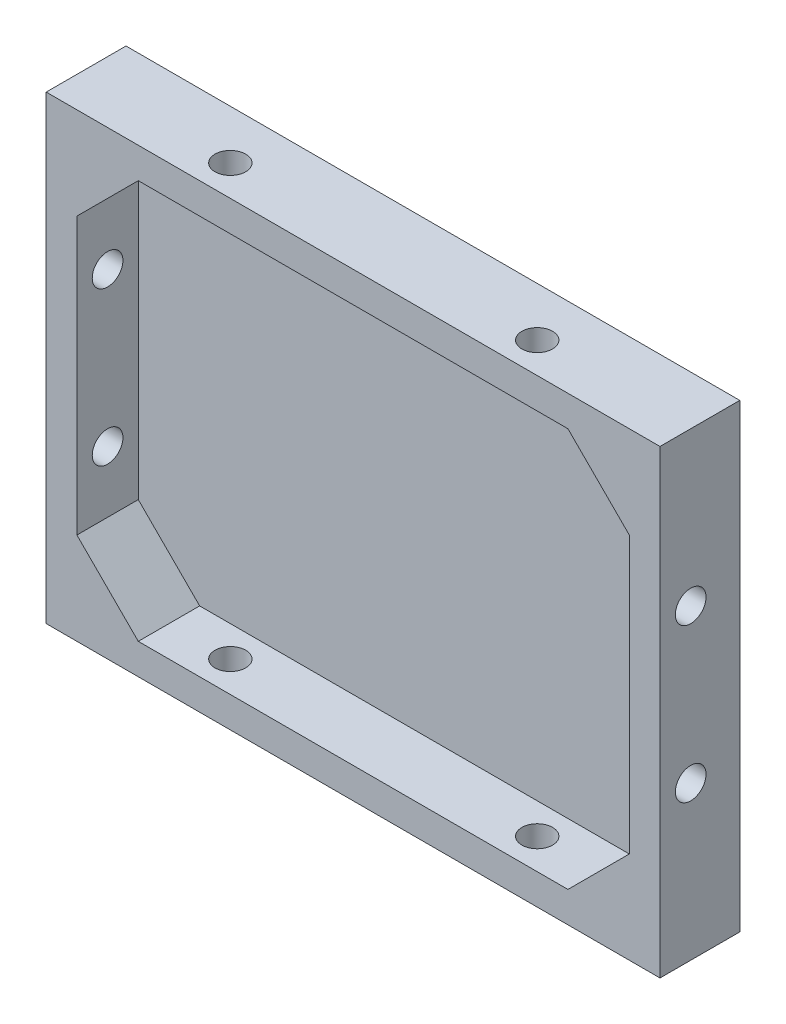
ISO-10303-21;
HEADER;
FILE_DESCRIPTION(('STEP AP214'),'2;1');
FILE_NAME('part.step','',(''),(''),'','','');
FILE_SCHEMA(('AUTOMOTIVE_DESIGN { 1 0 10303 214 1 1 1 1 }'));
ENDSEC;
DATA;
#1=APPLICATION_CONTEXT('core data for automotive mechanical design processes');
#2=APPLICATION_PROTOCOL_DEFINITION('international standard','automotive_design',2000,#1);
#3=PRODUCT_CONTEXT('',#1,'mechanical');
#4=PRODUCT('Part','Part','',(#3));
#5=PRODUCT_RELATED_PRODUCT_CATEGORY('part','',(#4));
#6=PRODUCT_DEFINITION_FORMATION('','',#4);
#7=PRODUCT_DEFINITION_CONTEXT('part definition',#1,'design');
#8=PRODUCT_DEFINITION('design','',#6,#7);
#9=PRODUCT_DEFINITION_SHAPE('','',#8);
#10=(LENGTH_UNIT() NAMED_UNIT(*) SI_UNIT(.MILLI.,.METRE.));
#11=(NAMED_UNIT(*) PLANE_ANGLE_UNIT() SI_UNIT($,.RADIAN.));
#12=(NAMED_UNIT(*) SI_UNIT($,.STERADIAN.) SOLID_ANGLE_UNIT());
#13=UNCERTAINTY_MEASURE_WITH_UNIT(LENGTH_MEASURE(1.E-05),#10,'distance_accuracy_value','');
#14=(GEOMETRIC_REPRESENTATION_CONTEXT(3) GLOBAL_UNCERTAINTY_ASSIGNED_CONTEXT((#13)) GLOBAL_UNIT_ASSIGNED_CONTEXT((#10,
#11,#12)) REPRESENTATION_CONTEXT('',''));
#15=CARTESIAN_POINT('',(0.,0.,0.));
#16=DIRECTION('',(0.,0.,1.));
#17=DIRECTION('',(1.,0.,0.));
#18=AXIS2_PLACEMENT_3D('',#15,#16,#17);
#19=CARTESIAN_POINT('',(0.,0.,3.));
#20=DIRECTION('',(0.,0.,1.));
#21=DIRECTION('',(1.,0.,0.));
#22=AXIS2_PLACEMENT_3D('',#19,#20,#21);
#23=PLANE('',#22);
#24=DIRECTION('',(0.,-1.,0.));
#25=VECTOR('',#24,1.);
#26=CARTESIAN_POINT('',(-40.8815636921236,33.7284482758621,3.));
#27=LINE('',#26,#25);
#28=CARTESIAN_POINT('',(-40.8815636921236,18.7284482758621,3.));
#29=VERTEX_POINT('',#28);
#30=CARTESIAN_POINT('',(-40.8815636921236,-26.2715517241379,3.));
#31=VERTEX_POINT('',#30);
#32=EDGE_CURVE('E141',#29,#31,#27,.T.);
#33=ORIENTED_EDGE('',*,*,#32,.T.);
#34=DIRECTION('',(-0.707106781186548,0.707106781186547,0.));
#35=VECTOR('',#34,1.);
#36=CARTESIAN_POINT('',(-30.8815636921236,-36.2715517241379,3.));
#37=LINE('',#36,#35);
#38=CARTESIAN_POINT('',(-30.8815636921236,-36.2715517241379,3.));
#39=VERTEX_POINT('',#38);
#40=EDGE_CURVE('E50',#39,#31,#37,.T.);
#41=ORIENTED_EDGE('',*,*,#40,.F.);
#42=DIRECTION('',(1.,0.,0.));
#43=VECTOR('',#42,1.);
#44=CARTESIAN_POINT('',(-45.8815636921236,-36.2715517241379,3.));
#45=LINE('',#44,#43);
#46=CARTESIAN_POINT('',(39.1184363078764,-36.2715517241379,3.));
#47=VERTEX_POINT('',#46);
#48=EDGE_CURVE('E231',#39,#47,#45,.T.);
#49=ORIENTED_EDGE('',*,*,#48,.T.);
#50=DIRECTION('',(-0.707106781186547,-0.707106781186548,0.));
#51=VECTOR('',#50,1.);
#52=CARTESIAN_POINT('',(49.1184363078764,-26.2715517241379,3.));
#53=LINE('',#52,#51);
#54=CARTESIAN_POINT('',(49.1184363078764,-26.2715517241379,3.));
#55=VERTEX_POINT('',#54);
#56=EDGE_CURVE('E238',#55,#47,#53,.T.);
#57=ORIENTED_EDGE('',*,*,#56,.F.);
#58=DIRECTION('',(0.,1.,0.));
#59=VECTOR('',#58,1.);
#60=CARTESIAN_POINT('',(49.1184363078764,33.7284482758621,3.));
#61=LINE('',#60,#59);
#62=CARTESIAN_POINT('',(49.1184363078764,18.7284482758621,3.));
#63=VERTEX_POINT('',#62);
#64=EDGE_CURVE('E154',#55,#63,#61,.T.);
#65=ORIENTED_EDGE('',*,*,#64,.T.);
#66=DIRECTION('',(0.707106781186548,-0.707106781186547,0.));
#67=VECTOR('',#66,1.);
#68=CARTESIAN_POINT('',(49.1184363078764,18.7284482758621,3.));
#69=LINE('',#68,#67);
#70=CARTESIAN_POINT('',(39.1184363078764,28.7284482758621,3.));
#71=VERTEX_POINT('',#70);
#72=EDGE_CURVE('E235',#71,#63,#69,.T.);
#73=ORIENTED_EDGE('',*,*,#72,.F.);
#74=DIRECTION('',(-1.,0.,0.));
#75=VECTOR('',#74,1.);
#76=CARTESIAN_POINT('',(-45.8815636921236,28.7284482758621,3.));
#77=LINE('',#76,#75);
#78=CARTESIAN_POINT('',(-30.8815636921236,28.7284482758621,3.));
#79=VERTEX_POINT('',#78);
#80=EDGE_CURVE('E150',#71,#79,#77,.T.);
#81=ORIENTED_EDGE('',*,*,#80,.T.);
#82=DIRECTION('',(0.707106781186548,0.707106781186548,0.));
#83=VECTOR('',#82,1.);
#84=CARTESIAN_POINT('',(-30.8815636921236,28.7284482758621,3.));
#85=LINE('',#84,#83);
#86=EDGE_CURVE('E137',#29,#79,#85,.T.);
#87=ORIENTED_EDGE('',*,*,#86,.F.);
#88=EDGE_LOOP('',(#33,#41,#49,#57,#65,#73,#81,#87));
#89=FACE_BOUND('',#88,.T.);
#90=ADVANCED_FACE('F33',(#89),#23,.T.);
#91=CARTESIAN_POINT('',(-45.8815636921236,-36.2715517241379,13.));
#92=DIRECTION('',(0.,1.,0.));
#93=DIRECTION('',(0.,0.,1.));
#94=AXIS2_PLACEMENT_3D('',#91,#92,#93);
#95=PLANE('',#94);
#96=CARTESIAN_POINT('',(29.1184363078764,-36.2715517241379,8.));
#97=DIRECTION('',(0.,1.,0.));
#98=DIRECTION('',(0.,0.,1.));
#99=AXIS2_PLACEMENT_3D('',#96,#97,#98);
#100=CIRCLE('',#99,2.5);
#101=CARTESIAN_POINT('',(29.1184363078764,-36.2715517241379,10.5));
#102=VERTEX_POINT('',#101);
#103=EDGE_CURVE('E213',#102,#102,#100,.T.);
#104=ORIENTED_EDGE('',*,*,#103,.F.);
#105=EDGE_LOOP('',(#104));
#106=FACE_BOUND('',#105,.T.);
#107=CARTESIAN_POINT('',(-20.8815636921236,-36.2715517241379,8.));
#108=DIRECTION('',(0.,1.,0.));
#109=DIRECTION('',(0.,0.,1.));
#110=AXIS2_PLACEMENT_3D('',#107,#108,#109);
#111=CIRCLE('',#110,2.5);
#112=CARTESIAN_POINT('',(-20.8815636921236,-36.2715517241379,10.5));
#113=VERTEX_POINT('',#112);
#114=EDGE_CURVE('E200',#113,#113,#111,.T.);
#115=ORIENTED_EDGE('',*,*,#114,.F.);
#116=EDGE_LOOP('',(#115));
#117=FACE_BOUND('',#116,.T.);
#118=ORIENTED_EDGE('',*,*,#48,.F.);
#119=DIRECTION('',(0.,0.,-1.));
#120=VECTOR('',#119,1.);
#121=CARTESIAN_POINT('',(-30.8815636921236,-36.2715517241379,27.142135623731));
#122=LINE('',#121,#120);
#123=CARTESIAN_POINT('',(-30.8815636921236,-36.2715517241379,13.));
#124=VERTEX_POINT('',#123);
#125=EDGE_CURVE('E284',#124,#39,#122,.T.);
#126=ORIENTED_EDGE('',*,*,#125,.F.);
#127=DIRECTION('',(1.,0.,0.));
#128=VECTOR('',#127,1.);
#129=CARTESIAN_POINT('',(-45.8815636921236,-36.2715517241379,13.));
#130=LINE('',#129,#128);
#131=CARTESIAN_POINT('',(39.1184363078764,-36.2715517241379,13.));
#132=VERTEX_POINT('',#131);
#133=EDGE_CURVE('E149',#124,#132,#130,.T.);
#134=ORIENTED_EDGE('',*,*,#133,.T.);
#135=DIRECTION('',(0.,0.,-1.));
#136=VECTOR('',#135,1.);
#137=CARTESIAN_POINT('',(39.1184363078764,-36.2715517241379,27.142135623731));
#138=LINE('',#137,#136);
#139=EDGE_CURVE('E258',#132,#47,#138,.T.);
#140=ORIENTED_EDGE('',*,*,#139,.T.);
#141=EDGE_LOOP('',(#118,#126,#134,#140));
#142=FACE_BOUND('',#141,.T.);
#143=ADVANCED_FACE('F298',(#106,#117,#142),#95,.T.);
#144=CARTESIAN_POINT('',(-40.8815636921236,33.7284482758621,13.));
#145=DIRECTION('',(1.,0.,0.));
#146=DIRECTION('',(0.,1.,0.));
#147=AXIS2_PLACEMENT_3D('',#144,#145,#146);
#148=PLANE('',#147);
#149=CARTESIAN_POINT('',(-40.8815636921236,8.72844827586206,8.));
#150=DIRECTION('',(1.,0.,0.));
#151=DIRECTION('',(0.,1.,0.));
#152=AXIS2_PLACEMENT_3D('',#149,#150,#151);
#153=CIRCLE('',#152,2.5);
#154=CARTESIAN_POINT('',(-40.8815636921236,11.2284482758621,8.));
#155=VERTEX_POINT('',#154);
#156=EDGE_CURVE('E196',#155,#155,#153,.T.);
#157=ORIENTED_EDGE('',*,*,#156,.F.);
#158=EDGE_LOOP('',(#157));
#159=FACE_BOUND('',#158,.T.);
#160=CARTESIAN_POINT('',(-40.8815636921236,-16.2715517241379,8.));
#161=DIRECTION('',(1.,0.,0.));
#162=DIRECTION('',(0.,1.,0.));
#163=AXIS2_PLACEMENT_3D('',#160,#161,#162);
#164=CIRCLE('',#163,2.5);
#165=CARTESIAN_POINT('',(-40.8815636921236,-13.7715517241379,8.));
#166=VERTEX_POINT('',#165);
#167=EDGE_CURVE('E192',#166,#166,#164,.T.);
#168=ORIENTED_EDGE('',*,*,#167,.F.);
#169=EDGE_LOOP('',(#168));
#170=FACE_BOUND('',#169,.T.);
#171=DIRECTION('',(0.,-1.,0.));
#172=VECTOR('',#171,1.);
#173=CARTESIAN_POINT('',(-40.8815636921236,33.7284482758621,13.));
#174=LINE('',#173,#172);
#175=CARTESIAN_POINT('',(-40.8815636921236,18.7284482758621,13.));
#176=VERTEX_POINT('',#175);
#177=CARTESIAN_POINT('',(-40.8815636921236,-26.2715517241379,13.));
#178=VERTEX_POINT('',#177);
#179=EDGE_CURVE('E140',#176,#178,#174,.T.);
#180=ORIENTED_EDGE('',*,*,#179,.T.);
#181=DIRECTION('',(0.,0.,-1.));
#182=VECTOR('',#181,1.);
#183=CARTESIAN_POINT('',(-40.8815636921236,-26.2715517241379,27.142135623731));
#184=LINE('',#183,#182);
#185=EDGE_CURVE('E58',#178,#31,#184,.T.);
#186=ORIENTED_EDGE('',*,*,#185,.T.);
#187=ORIENTED_EDGE('',*,*,#32,.F.);
#188=DIRECTION('',(0.,0.,-1.));
#189=VECTOR('',#188,1.);
#190=CARTESIAN_POINT('',(-40.8815636921236,18.7284482758621,27.142135623731));
#191=LINE('',#190,#189);
#192=EDGE_CURVE('E129',#176,#29,#191,.T.);
#193=ORIENTED_EDGE('',*,*,#192,.F.);
#194=EDGE_LOOP('',(#180,#186,#187,#193));
#195=FACE_BOUND('',#194,.T.);
#196=ADVANCED_FACE('F139',(#159,#170,#195),#148,.T.);
#197=CARTESIAN_POINT('',(49.1184363078764,33.7284482758621,13.));
#198=DIRECTION('',(-1.,0.,0.));
#199=DIRECTION('',(0.,0.,1.));
#200=AXIS2_PLACEMENT_3D('',#197,#198,#199);
#201=PLANE('',#200);
#202=CARTESIAN_POINT('',(49.1184363078764,8.72844827586206,8.));
#203=DIRECTION('',(-1.,0.,0.));
#204=DIRECTION('',(0.,0.,1.));
#205=AXIS2_PLACEMENT_3D('',#202,#203,#204);
#206=CIRCLE('',#205,2.5);
#207=CARTESIAN_POINT('',(49.1184363078764,6.22844827586206,8.));
#208=VERTEX_POINT('',#207);
#209=EDGE_CURVE('E194',#208,#208,#206,.T.);
#210=ORIENTED_EDGE('',*,*,#209,.F.);
#211=EDGE_LOOP('',(#210));
#212=FACE_BOUND('',#211,.T.);
#213=CARTESIAN_POINT('',(49.1184363078764,-16.2715517241379,8.));
#214=DIRECTION('',(-1.,0.,0.));
#215=DIRECTION('',(0.,0.,1.));
#216=AXIS2_PLACEMENT_3D('',#213,#214,#215);
#217=CIRCLE('',#216,2.5);
#218=CARTESIAN_POINT('',(49.1184363078764,-18.7715517241379,8.));
#219=VERTEX_POINT('',#218);
#220=EDGE_CURVE('E189',#219,#219,#217,.T.);
#221=ORIENTED_EDGE('',*,*,#220,.F.);
#222=EDGE_LOOP('',(#221));
#223=FACE_BOUND('',#222,.T.);
#224=ORIENTED_EDGE('',*,*,#64,.F.);
#225=DIRECTION('',(0.,0.,-1.));
#226=VECTOR('',#225,1.);
#227=CARTESIAN_POINT('',(49.1184363078764,-26.2715517241379,27.142135623731));
#228=LINE('',#227,#226);
#229=CARTESIAN_POINT('',(49.1184363078764,-26.2715517241379,13.));
#230=VERTEX_POINT('',#229);
#231=EDGE_CURVE('E291',#230,#55,#228,.T.);
#232=ORIENTED_EDGE('',*,*,#231,.F.);
#233=DIRECTION('',(0.,1.,0.));
#234=VECTOR('',#233,1.);
#235=CARTESIAN_POINT('',(49.1184363078764,33.7284482758621,13.));
#236=LINE('',#235,#234);
#237=CARTESIAN_POINT('',(49.1184363078764,18.7284482758621,13.));
#238=VERTEX_POINT('',#237);
#239=EDGE_CURVE('E152',#230,#238,#236,.T.);
#240=ORIENTED_EDGE('',*,*,#239,.T.);
#241=DIRECTION('',(0.,0.,-1.));
#242=VECTOR('',#241,1.);
#243=CARTESIAN_POINT('',(49.1184363078764,18.7284482758621,27.142135623731));
#244=LINE('',#243,#242);
#245=EDGE_CURVE('E242',#238,#63,#244,.T.);
#246=ORIENTED_EDGE('',*,*,#245,.T.);
#247=EDGE_LOOP('',(#224,#232,#240,#246));
#248=FACE_BOUND('',#247,.T.);
#249=ADVANCED_FACE('F243',(#212,#223,#248),#201,.T.);
#250=CARTESIAN_POINT('',(-45.8815636921236,28.7284482758621,13.));
#251=DIRECTION('',(0.,-1.,0.));
#252=DIRECTION('',(0.,0.,-1.));
#253=AXIS2_PLACEMENT_3D('',#250,#251,#252);
#254=PLANE('',#253);
#255=CARTESIAN_POINT('',(29.1184363078764,28.7284482758621,8.));
#256=DIRECTION('',(0.,-1.,0.));
#257=DIRECTION('',(0.,0.,-1.));
#258=AXIS2_PLACEMENT_3D('',#255,#256,#257);
#259=CIRCLE('',#258,2.5);
#260=CARTESIAN_POINT('',(29.1184363078764,28.7284482758621,5.5));
#261=VERTEX_POINT('',#260);
#262=EDGE_CURVE('E37',#261,#261,#259,.T.);
#263=ORIENTED_EDGE('',*,*,#262,.F.);
#264=EDGE_LOOP('',(#263));
#265=FACE_BOUND('',#264,.T.);
#266=CARTESIAN_POINT('',(-20.8815636921236,28.7284482758621,8.));
#267=DIRECTION('',(0.,-1.,0.));
#268=DIRECTION('',(0.,0.,-1.));
#269=AXIS2_PLACEMENT_3D('',#266,#267,#268);
#270=CIRCLE('',#269,2.5);
#271=CARTESIAN_POINT('',(-20.8815636921236,28.7284482758621,5.5));
#272=VERTEX_POINT('',#271);
#273=EDGE_CURVE('E198',#272,#272,#270,.T.);
#274=ORIENTED_EDGE('',*,*,#273,.F.);
#275=EDGE_LOOP('',(#274));
#276=FACE_BOUND('',#275,.T.);
#277=ORIENTED_EDGE('',*,*,#80,.F.);
#278=DIRECTION('',(0.,0.,-1.));
#279=VECTOR('',#278,1.);
#280=CARTESIAN_POINT('',(39.1184363078764,28.7284482758621,27.142135623731));
#281=LINE('',#280,#279);
#282=CARTESIAN_POINT('',(39.1184363078764,28.7284482758621,13.));
#283=VERTEX_POINT('',#282);
#284=EDGE_CURVE('E252',#283,#71,#281,.T.);
#285=ORIENTED_EDGE('',*,*,#284,.F.);
#286=DIRECTION('',(-1.,0.,0.));
#287=VECTOR('',#286,1.);
#288=CARTESIAN_POINT('',(-45.8815636921236,28.7284482758621,13.));
#289=LINE('',#288,#287);
#290=CARTESIAN_POINT('',(-30.8815636921236,28.7284482758621,13.));
#291=VERTEX_POINT('',#290);
#292=EDGE_CURVE('E159',#283,#291,#289,.T.);
#293=ORIENTED_EDGE('',*,*,#292,.T.);
#294=DIRECTION('',(0.,0.,-1.));
#295=VECTOR('',#294,1.);
#296=CARTESIAN_POINT('',(-30.8815636921236,28.7284482758621,27.142135623731));
#297=LINE('',#296,#295);
#298=EDGE_CURVE('E132',#291,#79,#297,.T.);
#299=ORIENTED_EDGE('',*,*,#298,.T.);
#300=EDGE_LOOP('',(#277,#285,#293,#299));
#301=FACE_BOUND('',#300,.T.);
#302=ADVANCED_FACE('F276',(#265,#276,#301),#254,.T.);
#303=CARTESIAN_POINT('',(-45.8815636921236,33.7284482758621,13.));
#304=DIRECTION('',(1.,0.,0.));
#305=DIRECTION('',(0.,1.,0.));
#306=AXIS2_PLACEMENT_3D('',#303,#304,#305);
#307=PLANE('',#306);
#308=CARTESIAN_POINT('',(-45.8815636921236,8.72844827586206,8.));
#309=DIRECTION('',(-1.,0.,0.));
#310=DIRECTION('',(0.,-1.,0.));
#311=AXIS2_PLACEMENT_3D('',#308,#309,#310);
#312=CIRCLE('',#311,2.5);
#313=CARTESIAN_POINT('',(-45.8815636921236,6.22844827586206,8.));
#314=VERTEX_POINT('',#313);
#315=EDGE_CURVE('E197',#314,#314,#312,.T.);
#316=ORIENTED_EDGE('',*,*,#315,.F.);
#317=EDGE_LOOP('',(#316));
#318=FACE_BOUND('',#317,.T.);
#319=CARTESIAN_POINT('',(-45.8815636921236,-16.2715517241379,8.));
#320=DIRECTION('',(-1.,0.,0.));
#321=DIRECTION('',(0.,-1.,0.));
#322=AXIS2_PLACEMENT_3D('',#319,#320,#321);
#323=CIRCLE('',#322,2.5);
#324=CARTESIAN_POINT('',(-45.8815636921236,-18.7715517241379,8.));
#325=VERTEX_POINT('',#324);
#326=EDGE_CURVE('E223',#325,#325,#323,.T.);
#327=ORIENTED_EDGE('',*,*,#326,.F.);
#328=EDGE_LOOP('',(#327));
#329=FACE_BOUND('',#328,.T.);
#330=DIRECTION('',(0.,-1.,0.));
#331=VECTOR('',#330,1.);
#332=CARTESIAN_POINT('',(-45.8815636921236,33.7284482758621,0.));
#333=LINE('',#332,#331);
#334=CARTESIAN_POINT('',(-45.8815636921236,33.7284482758621,0.));
#335=VERTEX_POINT('',#334);
#336=CARTESIAN_POINT('',(-45.8815636921236,-41.2715517241379,0.));
#337=VERTEX_POINT('',#336);
#338=EDGE_CURVE('E161',#335,#337,#333,.T.);
#339=ORIENTED_EDGE('',*,*,#338,.T.);
#340=DIRECTION('',(0.,0.,-1.));
#341=VECTOR('',#340,1.);
#342=CARTESIAN_POINT('',(-45.8815636921236,-41.2715517241379,13.));
#343=LINE('',#342,#341);
#344=CARTESIAN_POINT('',(-45.8815636921236,-41.2715517241379,13.));
#345=VERTEX_POINT('',#344);
#346=EDGE_CURVE('E11',#345,#337,#343,.T.);
#347=ORIENTED_EDGE('',*,*,#346,.F.);
#348=DIRECTION('',(0.,-1.,0.));
#349=VECTOR('',#348,1.);
#350=CARTESIAN_POINT('',(-45.8815636921236,33.7284482758621,13.));
#351=LINE('',#350,#349);
#352=CARTESIAN_POINT('',(-45.8815636921236,33.7284482758621,13.));
#353=VERTEX_POINT('',#352);
#354=EDGE_CURVE('E162',#353,#345,#351,.T.);
#355=ORIENTED_EDGE('',*,*,#354,.F.);
#356=DIRECTION('',(0.,0.,-1.));
#357=VECTOR('',#356,1.);
#358=CARTESIAN_POINT('',(-45.8815636921236,33.7284482758621,13.));
#359=LINE('',#358,#357);
#360=EDGE_CURVE('E172',#353,#335,#359,.T.);
#361=ORIENTED_EDGE('',*,*,#360,.T.);
#362=EDGE_LOOP('',(#339,#347,#355,#361));
#363=FACE_BOUND('',#362,.T.);
#364=ADVANCED_FACE('F35',(#318,#329,#363),#307,.F.);
#365=CARTESIAN_POINT('',(-45.8815636921236,-41.2715517241379,13.));
#366=DIRECTION('',(0.,1.,0.));
#367=DIRECTION('',(0.,0.,1.));
#368=AXIS2_PLACEMENT_3D('',#365,#366,#367);
#369=PLANE('',#368);
#370=CARTESIAN_POINT('',(29.1184363078764,-41.2715517241379,8.));
#371=DIRECTION('',(0.,-1.,0.));
#372=DIRECTION('',(0.,0.,-1.));
#373=AXIS2_PLACEMENT_3D('',#370,#371,#372);
#374=CIRCLE('',#373,2.5);
#375=CARTESIAN_POINT('',(29.1184363078764,-41.2715517241379,5.5));
#376=VERTEX_POINT('',#375);
#377=EDGE_CURVE('E136',#376,#376,#374,.T.);
#378=ORIENTED_EDGE('',*,*,#377,.F.);
#379=EDGE_LOOP('',(#378));
#380=FACE_BOUND('',#379,.T.);
#381=CARTESIAN_POINT('',(-20.8815636921236,-41.2715517241379,8.));
#382=DIRECTION('',(0.,-1.,0.));
#383=DIRECTION('',(0.,0.,-1.));
#384=AXIS2_PLACEMENT_3D('',#381,#382,#383);
#385=CIRCLE('',#384,2.5);
#386=CARTESIAN_POINT('',(-20.8815636921236,-41.2715517241379,5.5));
#387=VERTEX_POINT('',#386);
#388=EDGE_CURVE('E208',#387,#387,#385,.T.);
#389=ORIENTED_EDGE('',*,*,#388,.F.);
#390=EDGE_LOOP('',(#389));
#391=FACE_BOUND('',#390,.T.);
#392=DIRECTION('',(1.,0.,0.));
#393=VECTOR('',#392,1.);
#394=CARTESIAN_POINT('',(-45.8815636921236,-41.2715517241379,0.));
#395=LINE('',#394,#393);
#396=CARTESIAN_POINT('',(54.1184363078764,-41.2715517241379,0.));
#397=VERTEX_POINT('',#396);
#398=EDGE_CURVE('E175',#337,#397,#395,.T.);
#399=ORIENTED_EDGE('',*,*,#398,.T.);
#400=DIRECTION('',(0.,0.,-1.));
#401=VECTOR('',#400,1.);
#402=CARTESIAN_POINT('',(54.1184363078764,-41.2715517241379,13.));
#403=LINE('',#402,#401);
#404=CARTESIAN_POINT('',(54.1184363078764,-41.2715517241379,13.));
#405=VERTEX_POINT('',#404);
#406=EDGE_CURVE('E42',#405,#397,#403,.T.);
#407=ORIENTED_EDGE('',*,*,#406,.F.);
#408=DIRECTION('',(1.,0.,0.));
#409=VECTOR('',#408,1.);
#410=CARTESIAN_POINT('',(-45.8815636921236,-41.2715517241379,13.));
#411=LINE('',#410,#409);
#412=EDGE_CURVE('E165',#345,#405,#411,.T.);
#413=ORIENTED_EDGE('',*,*,#412,.F.);
#414=ORIENTED_EDGE('',*,*,#346,.T.);
#415=EDGE_LOOP('',(#399,#407,#413,#414));
#416=FACE_BOUND('',#415,.T.);
#417=ADVANCED_FACE('F330',(#380,#391,#416),#369,.F.);
#418=CARTESIAN_POINT('',(54.1184363078764,33.7284482758621,13.));
#419=DIRECTION('',(-1.,0.,0.));
#420=DIRECTION('',(0.,0.,1.));
#421=AXIS2_PLACEMENT_3D('',#418,#419,#420);
#422=PLANE('',#421);
#423=CARTESIAN_POINT('',(54.1184363078764,8.72844827586206,8.));
#424=DIRECTION('',(-1.,0.,0.));
#425=DIRECTION('',(0.,0.,1.));
#426=AXIS2_PLACEMENT_3D('',#423,#424,#425);
#427=CIRCLE('',#426,2.5);
#428=CARTESIAN_POINT('',(54.1184363078764,6.22844827586206,8.));
#429=VERTEX_POINT('',#428);
#430=EDGE_CURVE('E205',#429,#429,#427,.F.);
#431=ORIENTED_EDGE('',*,*,#430,.F.);
#432=EDGE_LOOP('',(#431));
#433=FACE_BOUND('',#432,.T.);
#434=CARTESIAN_POINT('',(54.1184363078764,-16.2715517241379,8.));
#435=DIRECTION('',(-1.,0.,0.));
#436=DIRECTION('',(0.,0.,1.));
#437=AXIS2_PLACEMENT_3D('',#434,#435,#436);
#438=CIRCLE('',#437,2.5);
#439=CARTESIAN_POINT('',(54.1184363078764,-18.7715517241379,8.));
#440=VERTEX_POINT('',#439);
#441=EDGE_CURVE('E193',#440,#440,#438,.F.);
#442=ORIENTED_EDGE('',*,*,#441,.F.);
#443=EDGE_LOOP('',(#442));
#444=FACE_BOUND('',#443,.T.);
#445=DIRECTION('',(0.,1.,0.));
#446=VECTOR('',#445,1.);
#447=CARTESIAN_POINT('',(54.1184363078764,33.7284482758621,0.));
#448=LINE('',#447,#446);
#449=CARTESIAN_POINT('',(54.1184363078764,33.7284482758621,0.));
#450=VERTEX_POINT('',#449);
#451=EDGE_CURVE('E178',#397,#450,#448,.T.);
#452=ORIENTED_EDGE('',*,*,#451,.T.);
#453=DIRECTION('',(0.,0.,-1.));
#454=VECTOR('',#453,1.);
#455=CARTESIAN_POINT('',(54.1184363078764,33.7284482758621,13.));
#456=LINE('',#455,#454);
#457=CARTESIAN_POINT('',(54.1184363078764,33.7284482758621,13.));
#458=VERTEX_POINT('',#457);
#459=EDGE_CURVE('E184',#458,#450,#456,.T.);
#460=ORIENTED_EDGE('',*,*,#459,.F.);
#461=DIRECTION('',(0.,1.,0.));
#462=VECTOR('',#461,1.);
#463=CARTESIAN_POINT('',(54.1184363078764,23.728448275862,13.));
#464=LINE('',#463,#462);
#465=EDGE_CURVE('E168',#405,#458,#464,.T.);
#466=ORIENTED_EDGE('',*,*,#465,.F.);
#467=ORIENTED_EDGE('',*,*,#406,.T.);
#468=EDGE_LOOP('',(#452,#460,#466,#467));
#469=FACE_BOUND('',#468,.T.);
#470=ADVANCED_FACE('F327',(#433,#444,#469),#422,.F.);
#471=CARTESIAN_POINT('',(-45.8815636921236,33.7284482758621,13.));
#472=DIRECTION('',(0.,-1.,0.));
#473=DIRECTION('',(0.,0.,-1.));
#474=AXIS2_PLACEMENT_3D('',#471,#472,#473);
#475=PLANE('',#474);
#476=CARTESIAN_POINT('',(29.1184363078764,33.7284482758621,8.));
#477=DIRECTION('',(0.,-1.,0.));
#478=DIRECTION('',(0.,0.,-1.));
#479=AXIS2_PLACEMENT_3D('',#476,#477,#478);
#480=CIRCLE('',#479,2.5);
#481=CARTESIAN_POINT('',(29.1184363078764,33.7284482758621,5.5));
#482=VERTEX_POINT('',#481);
#483=EDGE_CURVE('E265',#482,#482,#480,.F.);
#484=ORIENTED_EDGE('',*,*,#483,.F.);
#485=EDGE_LOOP('',(#484));
#486=FACE_BOUND('',#485,.T.);
#487=CARTESIAN_POINT('',(-20.8815636921236,33.7284482758621,8.));
#488=DIRECTION('',(0.,-1.,0.));
#489=DIRECTION('',(0.,0.,-1.));
#490=AXIS2_PLACEMENT_3D('',#487,#488,#489);
#491=CIRCLE('',#490,2.5);
#492=CARTESIAN_POINT('',(-20.8815636921236,33.7284482758621,5.5));
#493=VERTEX_POINT('',#492);
#494=EDGE_CURVE('E201',#493,#493,#491,.F.);
#495=ORIENTED_EDGE('',*,*,#494,.F.);
#496=EDGE_LOOP('',(#495));
#497=FACE_BOUND('',#496,.T.);
#498=DIRECTION('',(-1.,0.,0.));
#499=VECTOR('',#498,1.);
#500=CARTESIAN_POINT('',(-45.8815636921236,33.7284482758621,0.));
#501=LINE('',#500,#499);
#502=EDGE_CURVE('E166',#450,#335,#501,.T.);
#503=ORIENTED_EDGE('',*,*,#502,.T.);
#504=ORIENTED_EDGE('',*,*,#360,.F.);
#505=DIRECTION('',(-1.,0.,0.));
#506=VECTOR('',#505,1.);
#507=CARTESIAN_POINT('',(44.1184363078764,33.7284482758621,13.));
#508=LINE('',#507,#506);
#509=EDGE_CURVE('E170',#458,#353,#508,.T.);
#510=ORIENTED_EDGE('',*,*,#509,.F.);
#511=ORIENTED_EDGE('',*,*,#459,.T.);
#512=EDGE_LOOP('',(#503,#504,#510,#511));
#513=FACE_BOUND('',#512,.T.);
#514=ADVANCED_FACE('F320',(#486,#497,#513),#475,.F.);
#515=CARTESIAN_POINT('',(0.,0.,13.));
#516=DIRECTION('',(0.,0.,1.));
#517=DIRECTION('',(1.,0.,0.));
#518=AXIS2_PLACEMENT_3D('',#515,#516,#517);
#519=PLANE('',#518);
#520=ORIENTED_EDGE('',*,*,#133,.F.);
#521=DIRECTION('',(-0.707106781186548,0.707106781186547,0.));
#522=VECTOR('',#521,1.);
#523=CARTESIAN_POINT('',(-30.8815636921236,-36.2715517241379,13.));
#524=LINE('',#523,#522);
#525=EDGE_CURVE('E148',#124,#178,#524,.T.);
#526=ORIENTED_EDGE('',*,*,#525,.T.);
#527=ORIENTED_EDGE('',*,*,#179,.F.);
#528=DIRECTION('',(0.707106781186548,0.707106781186548,0.));
#529=VECTOR('',#528,1.);
#530=CARTESIAN_POINT('',(-30.8815636921236,28.7284482758621,13.));
#531=LINE('',#530,#529);
#532=EDGE_CURVE('E125',#176,#291,#531,.T.);
#533=ORIENTED_EDGE('',*,*,#532,.T.);
#534=ORIENTED_EDGE('',*,*,#292,.F.);
#535=DIRECTION('',(0.707106781186548,-0.707106781186547,0.));
#536=VECTOR('',#535,1.);
#537=CARTESIAN_POINT('',(49.1184363078764,18.7284482758621,13.));
#538=LINE('',#537,#536);
#539=EDGE_CURVE('E248',#283,#238,#538,.T.);
#540=ORIENTED_EDGE('',*,*,#539,.T.);
#541=ORIENTED_EDGE('',*,*,#239,.F.);
#542=DIRECTION('',(-0.707106781186547,-0.707106781186548,0.));
#543=VECTOR('',#542,1.);
#544=CARTESIAN_POINT('',(49.1184363078764,-26.2715517241379,13.));
#545=LINE('',#544,#543);
#546=EDGE_CURVE('E254',#230,#132,#545,.T.);
#547=ORIENTED_EDGE('',*,*,#546,.T.);
#548=EDGE_LOOP('',(#520,#526,#527,#533,#534,#540,#541,#547));
#549=FACE_BOUND('',#548,.T.);
#550=ORIENTED_EDGE('',*,*,#354,.T.);
#551=ORIENTED_EDGE('',*,*,#412,.T.);
#552=ORIENTED_EDGE('',*,*,#465,.T.);
#553=ORIENTED_EDGE('',*,*,#509,.T.);
#554=EDGE_LOOP('',(#550,#551,#552,#553));
#555=FACE_BOUND('',#554,.T.);
#556=ADVANCED_FACE('F145',(#549,#555),#519,.T.);
#557=CARTESIAN_POINT('',(0.,0.,0.));
#558=DIRECTION('',(0.,0.,1.));
#559=DIRECTION('',(1.,0.,0.));
#560=AXIS2_PLACEMENT_3D('',#557,#558,#559);
#561=PLANE('',#560);
#562=ORIENTED_EDGE('',*,*,#338,.F.);
#563=ORIENTED_EDGE('',*,*,#502,.F.);
#564=ORIENTED_EDGE('',*,*,#451,.F.);
#565=ORIENTED_EDGE('',*,*,#398,.F.);
#566=EDGE_LOOP('',(#562,#563,#564,#565));
#567=FACE_BOUND('',#566,.T.);
#568=ADVANCED_FACE('F319',(#567),#561,.F.);
#569=CARTESIAN_POINT('',(61.1895041197419,-16.2715517241379,8.));
#570=DIRECTION('',(-1.,0.,0.));
#571=DIRECTION('',(0.,-1.,0.));
#572=AXIS2_PLACEMENT_3D('',#569,#570,#571);
#573=CYLINDRICAL_SURFACE('',#572,2.5);
#574=CARTESIAN_POINT('',(49.1184363078764,-18.7715517241379,8.));
#575=CARTESIAN_POINT('',(49.1705196412098,-18.7715517241379,8.));
#576=CARTESIAN_POINT('',(49.2226029745431,-18.7715517241379,8.));
#577=CARTESIAN_POINT('',(49.3267696412098,-18.7715517241379,8.));
#578=CARTESIAN_POINT('',(49.3788529745431,-18.7715517241379,8.));
#579=CARTESIAN_POINT('',(49.4830196412098,-18.7715517241379,8.));
#580=CARTESIAN_POINT('',(49.5351029745431,-18.7715517241379,8.));
#581=CARTESIAN_POINT('',(49.6392696412098,-18.7715517241379,8.));
#582=CARTESIAN_POINT('',(49.6913529745431,-18.7715517241379,8.));
#583=CARTESIAN_POINT('',(49.7955196412098,-18.7715517241379,8.));
#584=CARTESIAN_POINT('',(49.8476029745431,-18.7715517241379,8.));
#585=CARTESIAN_POINT('',(49.9517696412098,-18.7715517241379,8.));
#586=CARTESIAN_POINT('',(50.0038529745431,-18.7715517241379,8.));
#587=CARTESIAN_POINT('',(50.1080196412098,-18.7715517241379,8.));
#588=CARTESIAN_POINT('',(50.1601029745431,-18.7715517241379,8.));
#589=CARTESIAN_POINT('',(50.2642696412098,-18.7715517241379,8.));
#590=CARTESIAN_POINT('',(50.3163529745431,-18.7715517241379,8.));
#591=CARTESIAN_POINT('',(50.4205196412098,-18.7715517241379,8.));
#592=CARTESIAN_POINT('',(50.4726029745431,-18.7715517241379,8.));
#593=CARTESIAN_POINT('',(50.5767696412098,-18.7715517241379,8.));
#594=CARTESIAN_POINT('',(50.6288529745431,-18.7715517241379,8.));
#595=CARTESIAN_POINT('',(50.7330196412098,-18.7715517241379,8.));
#596=CARTESIAN_POINT('',(50.7851029745431,-18.7715517241379,8.));
#597=CARTESIAN_POINT('',(50.8892696412098,-18.7715517241379,8.));
#598=CARTESIAN_POINT('',(50.9413529745431,-18.7715517241379,8.));
#599=CARTESIAN_POINT('',(51.0455196412098,-18.7715517241379,8.));
#600=CARTESIAN_POINT('',(51.0976029745431,-18.7715517241379,8.));
#601=CARTESIAN_POINT('',(51.2017696412098,-18.7715517241379,8.));
#602=CARTESIAN_POINT('',(51.2538529745431,-18.7715517241379,8.));
#603=CARTESIAN_POINT('',(51.3580196412098,-18.7715517241379,8.));
#604=CARTESIAN_POINT('',(51.4101029745431,-18.7715517241379,8.));
#605=CARTESIAN_POINT('',(51.5142696412098,-18.7715517241379,8.));
#606=CARTESIAN_POINT('',(51.5663529745431,-18.7715517241379,8.));
#607=CARTESIAN_POINT('',(51.6705196412098,-18.7715517241379,8.));
#608=CARTESIAN_POINT('',(51.7226029745431,-18.7715517241379,8.));
#609=CARTESIAN_POINT('',(51.8267696412098,-18.7715517241379,8.));
#610=CARTESIAN_POINT('',(51.8788529745431,-18.7715517241379,8.));
#611=CARTESIAN_POINT('',(51.9830196412098,-18.7715517241379,8.));
#612=CARTESIAN_POINT('',(52.0351029745431,-18.7715517241379,8.));
#613=CARTESIAN_POINT('',(52.1392696412098,-18.7715517241379,8.));
#614=CARTESIAN_POINT('',(52.1913529745431,-18.7715517241379,8.));
#615=CARTESIAN_POINT('',(52.2955196412098,-18.7715517241379,8.));
#616=CARTESIAN_POINT('',(52.3476029745431,-18.7715517241379,8.));
#617=CARTESIAN_POINT('',(52.4517696412098,-18.7715517241379,8.));
#618=CARTESIAN_POINT('',(52.5038529745431,-18.7715517241379,8.));
#619=CARTESIAN_POINT('',(52.6080196412098,-18.7715517241379,8.));
#620=CARTESIAN_POINT('',(52.6601029745431,-18.7715517241379,8.));
#621=CARTESIAN_POINT('',(52.7642696412098,-18.7715517241379,8.));
#622=CARTESIAN_POINT('',(52.8163529745431,-18.7715517241379,8.));
#623=CARTESIAN_POINT('',(52.9205196412098,-18.7715517241379,8.));
#624=CARTESIAN_POINT('',(52.9726029745431,-18.7715517241379,8.));
#625=CARTESIAN_POINT('',(53.0767696412098,-18.7715517241379,8.));
#626=CARTESIAN_POINT('',(53.1288529745431,-18.7715517241379,8.));
#627=CARTESIAN_POINT('',(53.2330196412098,-18.7715517241379,8.));
#628=CARTESIAN_POINT('',(53.2851029745431,-18.7715517241379,8.));
#629=CARTESIAN_POINT('',(53.3892696412098,-18.7715517241379,8.));
#630=CARTESIAN_POINT('',(53.4413529745431,-18.7715517241379,8.));
#631=CARTESIAN_POINT('',(53.5455196412098,-18.7715517241379,8.));
#632=CARTESIAN_POINT('',(53.5976029745431,-18.7715517241379,8.));
#633=CARTESIAN_POINT('',(53.7017696412098,-18.7715517241379,8.));
#634=CARTESIAN_POINT('',(53.7538529745431,-18.7715517241379,8.));
#635=CARTESIAN_POINT('',(53.8580196412098,-18.7715517241379,8.));
#636=CARTESIAN_POINT('',(53.9101029745431,-18.7715517241379,8.));
#637=CARTESIAN_POINT('',(54.0142696412098,-18.7715517241379,8.));
#638=CARTESIAN_POINT('',(54.0663529745431,-18.7715517241379,8.));
#639=CARTESIAN_POINT('',(54.1184363078764,-18.7715517241379,8.));
#640=B_SPLINE_CURVE_WITH_KNOTS('',3,(#574,#575,#576,#577,#578,#579,#580,#581,#582,#583,#584,
#585,#586,#587,#588,#589,#590,#591,#592,#593,#594,#595,#596,#597,#598,#599,#600,#601,#602,#603,
#604,#605,#606,#607,#608,#609,#610,#611,#612,#613,#614,#615,#616,#617,#618,#619,#620,#621,#622,
#623,#624,#625,#626,#627,#628,#629,#630,#631,#632,#633,#634,#635,#636,#637,#638,#639),
.UNSPECIFIED.,.F.,.F.,(4,2,2,2,2,2,2,2,2,2,2,2,2,2,2,2,2,2,2,2,2,2,2,2,2,2,2,2,2,2,2,2,4),(0.,
0.156250000000004,0.312500000000007,0.468750000000004,0.625000000000001,0.781250000000004,
0.937500000000001,1.09375,1.25,1.40625,1.5625,1.71875,1.875,2.03125,2.1875,2.34375000000001,2.5,
2.65625,2.8125,2.96875000000001,3.125,3.28125,3.4375,3.59375,3.75,3.90625,4.0625,4.21875,4.375,
4.53125,4.6875,4.84375,5.),.UNSPECIFIED.);
#641=EDGE_CURVE('BSEAM323',#219,#440,#640,.T.);
#642=ORIENTED_EDGE('',*,*,#220,.T.);
#643=ORIENTED_EDGE('',*,*,#441,.T.);
#644=ORIENTED_EDGE('',*,*,#641,.T.);
#645=ORIENTED_EDGE('',*,*,#641,.F.);
#646=EDGE_LOOP('',(#642,#644,#643,#645));
#647=FACE_BOUND('',#646,.T.);
#648=ADVANCED_FACE('F323',(#647),#573,.F.);
#649=ORIENTED_EDGE('',*,*,#167,.T.);
#650=EDGE_LOOP('',(#649));
#651=FACE_BOUND('',#650,.T.);
#652=ORIENTED_EDGE('',*,*,#326,.T.);
#653=EDGE_LOOP('',(#652));
#654=FACE_BOUND('',#653,.T.);
#655=ADVANCED_FACE('F371',(#651,#654),#573,.F.);
#656=CARTESIAN_POINT('',(61.1895041197419,8.72844827586206,8.));
#657=DIRECTION('',(-1.,0.,0.));
#658=DIRECTION('',(0.,-1.,0.));
#659=AXIS2_PLACEMENT_3D('',#656,#657,#658);
#660=CYLINDRICAL_SURFACE('',#659,2.5);
#661=CARTESIAN_POINT('',(49.1184363078764,6.22844827586206,8.));
#662=CARTESIAN_POINT('',(49.1705196412098,6.22844827586206,8.));
#663=CARTESIAN_POINT('',(49.2226029745431,6.22844827586206,8.));
#664=CARTESIAN_POINT('',(49.3267696412098,6.22844827586206,8.));
#665=CARTESIAN_POINT('',(49.3788529745431,6.22844827586206,8.));
#666=CARTESIAN_POINT('',(49.4830196412098,6.22844827586206,8.));
#667=CARTESIAN_POINT('',(49.5351029745431,6.22844827586206,8.));
#668=CARTESIAN_POINT('',(49.6392696412098,6.22844827586206,8.));
#669=CARTESIAN_POINT('',(49.6913529745431,6.22844827586206,8.));
#670=CARTESIAN_POINT('',(49.7955196412098,6.22844827586206,8.));
#671=CARTESIAN_POINT('',(49.8476029745431,6.22844827586206,8.));
#672=CARTESIAN_POINT('',(49.9517696412098,6.22844827586206,8.));
#673=CARTESIAN_POINT('',(50.0038529745431,6.22844827586206,8.));
#674=CARTESIAN_POINT('',(50.1080196412098,6.22844827586206,8.));
#675=CARTESIAN_POINT('',(50.1601029745431,6.22844827586206,8.));
#676=CARTESIAN_POINT('',(50.2642696412098,6.22844827586206,8.));
#677=CARTESIAN_POINT('',(50.3163529745431,6.22844827586206,8.));
#678=CARTESIAN_POINT('',(50.4205196412098,6.22844827586206,8.));
#679=CARTESIAN_POINT('',(50.4726029745431,6.22844827586206,8.));
#680=CARTESIAN_POINT('',(50.5767696412098,6.22844827586206,8.));
#681=CARTESIAN_POINT('',(50.6288529745431,6.22844827586206,8.));
#682=CARTESIAN_POINT('',(50.7330196412098,6.22844827586206,8.));
#683=CARTESIAN_POINT('',(50.7851029745431,6.22844827586206,8.));
#684=CARTESIAN_POINT('',(50.8892696412098,6.22844827586206,8.));
#685=CARTESIAN_POINT('',(50.9413529745431,6.22844827586206,8.));
#686=CARTESIAN_POINT('',(51.0455196412098,6.22844827586206,8.));
#687=CARTESIAN_POINT('',(51.0976029745431,6.22844827586206,8.));
#688=CARTESIAN_POINT('',(51.2017696412098,6.22844827586206,8.));
#689=CARTESIAN_POINT('',(51.2538529745431,6.22844827586206,8.));
#690=CARTESIAN_POINT('',(51.3580196412098,6.22844827586206,8.));
#691=CARTESIAN_POINT('',(51.4101029745431,6.22844827586206,8.));
#692=CARTESIAN_POINT('',(51.5142696412098,6.22844827586206,8.));
#693=CARTESIAN_POINT('',(51.5663529745431,6.22844827586206,8.));
#694=CARTESIAN_POINT('',(51.6705196412098,6.22844827586206,8.));
#695=CARTESIAN_POINT('',(51.7226029745431,6.22844827586206,8.));
#696=CARTESIAN_POINT('',(51.8267696412098,6.22844827586206,8.));
#697=CARTESIAN_POINT('',(51.8788529745431,6.22844827586206,8.));
#698=CARTESIAN_POINT('',(51.9830196412098,6.22844827586206,8.));
#699=CARTESIAN_POINT('',(52.0351029745431,6.22844827586206,8.));
#700=CARTESIAN_POINT('',(52.1392696412098,6.22844827586206,8.));
#701=CARTESIAN_POINT('',(52.1913529745431,6.22844827586206,8.));
#702=CARTESIAN_POINT('',(52.2955196412098,6.22844827586206,8.));
#703=CARTESIAN_POINT('',(52.3476029745431,6.22844827586206,8.));
#704=CARTESIAN_POINT('',(52.4517696412098,6.22844827586206,8.));
#705=CARTESIAN_POINT('',(52.5038529745431,6.22844827586206,8.));
#706=CARTESIAN_POINT('',(52.6080196412098,6.22844827586206,8.));
#707=CARTESIAN_POINT('',(52.6601029745431,6.22844827586206,8.));
#708=CARTESIAN_POINT('',(52.7642696412098,6.22844827586206,8.));
#709=CARTESIAN_POINT('',(52.8163529745431,6.22844827586206,8.));
#710=CARTESIAN_POINT('',(52.9205196412098,6.22844827586206,8.));
#711=CARTESIAN_POINT('',(52.9726029745431,6.22844827586206,8.));
#712=CARTESIAN_POINT('',(53.0767696412098,6.22844827586206,8.));
#713=CARTESIAN_POINT('',(53.1288529745431,6.22844827586206,8.));
#714=CARTESIAN_POINT('',(53.2330196412098,6.22844827586206,8.));
#715=CARTESIAN_POINT('',(53.2851029745431,6.22844827586206,8.));
#716=CARTESIAN_POINT('',(53.3892696412098,6.22844827586206,8.));
#717=CARTESIAN_POINT('',(53.4413529745431,6.22844827586206,8.));
#718=CARTESIAN_POINT('',(53.5455196412098,6.22844827586206,8.));
#719=CARTESIAN_POINT('',(53.5976029745431,6.22844827586206,8.));
#720=CARTESIAN_POINT('',(53.7017696412098,6.22844827586206,8.));
#721=CARTESIAN_POINT('',(53.7538529745431,6.22844827586206,8.));
#722=CARTESIAN_POINT('',(53.8580196412098,6.22844827586206,8.));
#723=CARTESIAN_POINT('',(53.9101029745431,6.22844827586206,8.));
#724=CARTESIAN_POINT('',(54.0142696412098,6.22844827586206,8.));
#725=CARTESIAN_POINT('',(54.0663529745431,6.22844827586206,8.));
#726=CARTESIAN_POINT('',(54.1184363078764,6.22844827586206,8.));
#727=B_SPLINE_CURVE_WITH_KNOTS('',3,(#661,#662,#663,#664,#665,#666,#667,#668,#669,#670,#671,
#672,#673,#674,#675,#676,#677,#678,#679,#680,#681,#682,#683,#684,#685,#686,#687,#688,#689,#690,
#691,#692,#693,#694,#695,#696,#697,#698,#699,#700,#701,#702,#703,#704,#705,#706,#707,#708,#709,
#710,#711,#712,#713,#714,#715,#716,#717,#718,#719,#720,#721,#722,#723,#724,#725,#726),
.UNSPECIFIED.,.F.,.F.,(4,2,2,2,2,2,2,2,2,2,2,2,2,2,2,2,2,2,2,2,2,2,2,2,2,2,2,2,2,2,2,2,4),(0.,
0.156250000000004,0.312500000000007,0.468750000000004,0.625000000000001,0.781250000000004,
0.937500000000001,1.09375,1.25,1.40625,1.5625,1.71875,1.875,2.03125,2.1875,2.34375000000001,2.5,
2.65625,2.8125,2.96875000000001,3.125,3.28125,3.4375,3.59375,3.75,3.90625,4.0625,4.21875,4.375,
4.53125,4.6875,4.84375,5.),.UNSPECIFIED.);
#728=EDGE_CURVE('BSEAM368',#208,#429,#727,.T.);
#729=ORIENTED_EDGE('',*,*,#209,.T.);
#730=ORIENTED_EDGE('',*,*,#430,.T.);
#731=ORIENTED_EDGE('',*,*,#728,.T.);
#732=ORIENTED_EDGE('',*,*,#728,.F.);
#733=EDGE_LOOP('',(#729,#731,#730,#732));
#734=FACE_BOUND('',#733,.T.);
#735=ADVANCED_FACE('F368',(#734),#660,.F.);
#736=ORIENTED_EDGE('',*,*,#156,.T.);
#737=EDGE_LOOP('',(#736));
#738=FACE_BOUND('',#737,.T.);
#739=ORIENTED_EDGE('',*,*,#315,.T.);
#740=EDGE_LOOP('',(#739));
#741=FACE_BOUND('',#740,.T.);
#742=ADVANCED_FACE('F365',(#738,#741),#660,.F.);
#743=CARTESIAN_POINT('',(-20.8815636921236,40.7995160877275,8.));
#744=DIRECTION('',(0.,-1.,0.));
#745=DIRECTION('',(0.,0.,-1.));
#746=AXIS2_PLACEMENT_3D('',#743,#744,#745);
#747=CYLINDRICAL_SURFACE('',#746,2.5);
#748=CARTESIAN_POINT('',(-20.8815636921236,28.7284482758621,5.5));
#749=CARTESIAN_POINT('',(-20.8815636921236,28.7805316091954,5.5));
#750=CARTESIAN_POINT('',(-20.8815636921236,28.8326149425287,5.5));
#751=CARTESIAN_POINT('',(-20.8815636921236,28.9367816091954,5.5));
#752=CARTESIAN_POINT('',(-20.8815636921236,28.9888649425287,5.5));
#753=CARTESIAN_POINT('',(-20.8815636921236,29.0930316091954,5.5));
#754=CARTESIAN_POINT('',(-20.8815636921236,29.1451149425287,5.5));
#755=CARTESIAN_POINT('',(-20.8815636921236,29.2492816091954,5.5));
#756=CARTESIAN_POINT('',(-20.8815636921236,29.3013649425287,5.5));
#757=CARTESIAN_POINT('',(-20.8815636921236,29.4055316091954,5.5));
#758=CARTESIAN_POINT('',(-20.8815636921236,29.4576149425287,5.5));
#759=CARTESIAN_POINT('',(-20.8815636921236,29.5617816091954,5.5));
#760=CARTESIAN_POINT('',(-20.8815636921236,29.6138649425287,5.5));
#761=CARTESIAN_POINT('',(-20.8815636921236,29.7180316091954,5.5));
#762=CARTESIAN_POINT('',(-20.8815636921236,29.7701149425287,5.5));
#763=CARTESIAN_POINT('',(-20.8815636921236,29.8742816091954,5.5));
#764=CARTESIAN_POINT('',(-20.8815636921236,29.9263649425287,5.5));
#765=CARTESIAN_POINT('',(-20.8815636921236,30.0305316091954,5.5));
#766=CARTESIAN_POINT('',(-20.8815636921236,30.0826149425287,5.5));
#767=CARTESIAN_POINT('',(-20.8815636921236,30.1867816091954,5.5));
#768=CARTESIAN_POINT('',(-20.8815636921236,30.2388649425287,5.5));
#769=CARTESIAN_POINT('',(-20.8815636921236,30.3430316091954,5.5));
#770=CARTESIAN_POINT('',(-20.8815636921236,30.3951149425287,5.5));
#771=CARTESIAN_POINT('',(-20.8815636921236,30.4992816091954,5.5));
#772=CARTESIAN_POINT('',(-20.8815636921236,30.5513649425287,5.5));
#773=CARTESIAN_POINT('',(-20.8815636921236,30.6555316091954,5.5));
#774=CARTESIAN_POINT('',(-20.8815636921236,30.7076149425287,5.5));
#775=CARTESIAN_POINT('',(-20.8815636921236,30.8117816091954,5.5));
#776=CARTESIAN_POINT('',(-20.8815636921236,30.8638649425287,5.5));
#777=CARTESIAN_POINT('',(-20.8815636921236,30.9680316091954,5.5));
#778=CARTESIAN_POINT('',(-20.8815636921236,31.0201149425287,5.5));
#779=CARTESIAN_POINT('',(-20.8815636921236,31.1242816091954,5.5));
#780=CARTESIAN_POINT('',(-20.8815636921236,31.1763649425287,5.5));
#781=CARTESIAN_POINT('',(-20.8815636921236,31.2805316091954,5.5));
#782=CARTESIAN_POINT('',(-20.8815636921236,31.3326149425287,5.5));
#783=CARTESIAN_POINT('',(-20.8815636921236,31.4367816091954,5.5));
#784=CARTESIAN_POINT('',(-20.8815636921236,31.4888649425287,5.5));
#785=CARTESIAN_POINT('',(-20.8815636921236,31.5930316091954,5.5));
#786=CARTESIAN_POINT('',(-20.8815636921236,31.6451149425287,5.5));
#787=CARTESIAN_POINT('',(-20.8815636921236,31.7492816091954,5.5));
#788=CARTESIAN_POINT('',(-20.8815636921236,31.8013649425287,5.5));
#789=CARTESIAN_POINT('',(-20.8815636921236,31.9055316091954,5.5));
#790=CARTESIAN_POINT('',(-20.8815636921236,31.9576149425287,5.5));
#791=CARTESIAN_POINT('',(-20.8815636921236,32.0617816091954,5.5));
#792=CARTESIAN_POINT('',(-20.8815636921236,32.1138649425287,5.5));
#793=CARTESIAN_POINT('',(-20.8815636921236,32.2180316091954,5.5));
#794=CARTESIAN_POINT('',(-20.8815636921236,32.2701149425287,5.5));
#795=CARTESIAN_POINT('',(-20.8815636921236,32.3742816091954,5.5));
#796=CARTESIAN_POINT('',(-20.8815636921236,32.4263649425287,5.5));
#797=CARTESIAN_POINT('',(-20.8815636921236,32.5305316091954,5.5));
#798=CARTESIAN_POINT('',(-20.8815636921236,32.5826149425287,5.5));
#799=CARTESIAN_POINT('',(-20.8815636921236,32.6867816091954,5.5));
#800=CARTESIAN_POINT('',(-20.8815636921236,32.7388649425287,5.5));
#801=CARTESIAN_POINT('',(-20.8815636921236,32.8430316091954,5.5));
#802=CARTESIAN_POINT('',(-20.8815636921236,32.8951149425287,5.5));
#803=CARTESIAN_POINT('',(-20.8815636921236,32.9992816091954,5.5));
#804=CARTESIAN_POINT('',(-20.8815636921236,33.0513649425287,5.5));
#805=CARTESIAN_POINT('',(-20.8815636921236,33.1555316091954,5.5));
#806=CARTESIAN_POINT('',(-20.8815636921236,33.2076149425287,5.5));
#807=CARTESIAN_POINT('',(-20.8815636921236,33.3117816091954,5.5));
#808=CARTESIAN_POINT('',(-20.8815636921236,33.3638649425287,5.5));
#809=CARTESIAN_POINT('',(-20.8815636921236,33.4680316091954,5.5));
#810=CARTESIAN_POINT('',(-20.8815636921236,33.5201149425287,5.5));
#811=CARTESIAN_POINT('',(-20.8815636921236,33.6242816091954,5.5));
#812=CARTESIAN_POINT('',(-20.8815636921236,33.6763649425287,5.5));
#813=CARTESIAN_POINT('',(-20.8815636921236,33.7284482758621,5.5));
#814=B_SPLINE_CURVE_WITH_KNOTS('',3,(#748,#749,#750,#751,#752,#753,#754,#755,#756,#757,#758,
#759,#760,#761,#762,#763,#764,#765,#766,#767,#768,#769,#770,#771,#772,#773,#774,#775,#776,#777,
#778,#779,#780,#781,#782,#783,#784,#785,#786,#787,#788,#789,#790,#791,#792,#793,#794,#795,#796,
#797,#798,#799,#800,#801,#802,#803,#804,#805,#806,#807,#808,#809,#810,#811,#812,#813),
.UNSPECIFIED.,.F.,.F.,(4,2,2,2,2,2,2,2,2,2,2,2,2,2,2,2,2,2,2,2,2,2,2,2,2,2,2,2,2,2,2,2,4),(0.,
0.15625,0.3125,0.46875,0.625000000000001,0.781250000000001,0.937499999999997,1.09375,1.25,
1.40625,1.5625,1.71875,1.875,2.03125,2.1875,2.34375,2.5,2.65625,2.8125,2.96875,3.125,3.28125,
3.4375,3.59375,3.75,3.90625,4.0625,4.21875,4.375,4.53125,4.68749999999999,4.84375,5.),.UNSPECIFIED.);
#815=EDGE_CURVE('BSEAM356',#272,#493,#814,.T.);
#816=ORIENTED_EDGE('',*,*,#273,.T.);
#817=ORIENTED_EDGE('',*,*,#494,.T.);
#818=ORIENTED_EDGE('',*,*,#815,.T.);
#819=ORIENTED_EDGE('',*,*,#815,.F.);
#820=EDGE_LOOP('',(#816,#818,#817,#819));
#821=FACE_BOUND('',#820,.T.);
#822=ADVANCED_FACE('F356',(#821),#747,.F.);
#823=ORIENTED_EDGE('',*,*,#114,.T.);
#824=EDGE_LOOP('',(#823));
#825=FACE_BOUND('',#824,.T.);
#826=ORIENTED_EDGE('',*,*,#388,.T.);
#827=EDGE_LOOP('',(#826));
#828=FACE_BOUND('',#827,.T.);
#829=ADVANCED_FACE('F354',(#825,#828),#747,.F.);
#830=CARTESIAN_POINT('',(29.1184363078764,40.7995160877275,8.));
#831=DIRECTION('',(0.,-1.,0.));
#832=DIRECTION('',(0.,0.,-1.));
#833=AXIS2_PLACEMENT_3D('',#830,#831,#832);
#834=CYLINDRICAL_SURFACE('',#833,2.5);
#835=CARTESIAN_POINT('',(29.1184363078764,28.7284482758621,5.5));
#836=CARTESIAN_POINT('',(29.1184363078764,28.7805316091954,5.5));
#837=CARTESIAN_POINT('',(29.1184363078764,28.8326149425287,5.5));
#838=CARTESIAN_POINT('',(29.1184363078764,28.9367816091954,5.5));
#839=CARTESIAN_POINT('',(29.1184363078764,28.9888649425287,5.5));
#840=CARTESIAN_POINT('',(29.1184363078764,29.0930316091954,5.5));
#841=CARTESIAN_POINT('',(29.1184363078764,29.1451149425287,5.5));
#842=CARTESIAN_POINT('',(29.1184363078764,29.2492816091954,5.5));
#843=CARTESIAN_POINT('',(29.1184363078764,29.3013649425287,5.5));
#844=CARTESIAN_POINT('',(29.1184363078764,29.4055316091954,5.5));
#845=CARTESIAN_POINT('',(29.1184363078764,29.4576149425287,5.5));
#846=CARTESIAN_POINT('',(29.1184363078764,29.5617816091954,5.5));
#847=CARTESIAN_POINT('',(29.1184363078764,29.6138649425287,5.5));
#848=CARTESIAN_POINT('',(29.1184363078764,29.7180316091954,5.5));
#849=CARTESIAN_POINT('',(29.1184363078764,29.7701149425287,5.5));
#850=CARTESIAN_POINT('',(29.1184363078764,29.8742816091954,5.5));
#851=CARTESIAN_POINT('',(29.1184363078764,29.9263649425287,5.5));
#852=CARTESIAN_POINT('',(29.1184363078764,30.0305316091954,5.5));
#853=CARTESIAN_POINT('',(29.1184363078764,30.0826149425287,5.5));
#854=CARTESIAN_POINT('',(29.1184363078764,30.1867816091954,5.5));
#855=CARTESIAN_POINT('',(29.1184363078764,30.2388649425287,5.5));
#856=CARTESIAN_POINT('',(29.1184363078764,30.3430316091954,5.5));
#857=CARTESIAN_POINT('',(29.1184363078764,30.3951149425287,5.5));
#858=CARTESIAN_POINT('',(29.1184363078764,30.4992816091954,5.5));
#859=CARTESIAN_POINT('',(29.1184363078764,30.5513649425287,5.5));
#860=CARTESIAN_POINT('',(29.1184363078764,30.6555316091954,5.5));
#861=CARTESIAN_POINT('',(29.1184363078764,30.7076149425287,5.5));
#862=CARTESIAN_POINT('',(29.1184363078764,30.8117816091954,5.5));
#863=CARTESIAN_POINT('',(29.1184363078764,30.8638649425287,5.5));
#864=CARTESIAN_POINT('',(29.1184363078764,30.9680316091954,5.5));
#865=CARTESIAN_POINT('',(29.1184363078764,31.0201149425287,5.5));
#866=CARTESIAN_POINT('',(29.1184363078764,31.1242816091954,5.5));
#867=CARTESIAN_POINT('',(29.1184363078764,31.1763649425287,5.5));
#868=CARTESIAN_POINT('',(29.1184363078764,31.2805316091954,5.5));
#869=CARTESIAN_POINT('',(29.1184363078764,31.3326149425287,5.5));
#870=CARTESIAN_POINT('',(29.1184363078764,31.4367816091954,5.5));
#871=CARTESIAN_POINT('',(29.1184363078764,31.4888649425287,5.5));
#872=CARTESIAN_POINT('',(29.1184363078764,31.5930316091954,5.5));
#873=CARTESIAN_POINT('',(29.1184363078764,31.6451149425287,5.5));
#874=CARTESIAN_POINT('',(29.1184363078764,31.7492816091954,5.5));
#875=CARTESIAN_POINT('',(29.1184363078764,31.8013649425287,5.5));
#876=CARTESIAN_POINT('',(29.1184363078764,31.9055316091954,5.5));
#877=CARTESIAN_POINT('',(29.1184363078764,31.9576149425287,5.5));
#878=CARTESIAN_POINT('',(29.1184363078764,32.0617816091954,5.5));
#879=CARTESIAN_POINT('',(29.1184363078764,32.1138649425287,5.5));
#880=CARTESIAN_POINT('',(29.1184363078764,32.2180316091954,5.5));
#881=CARTESIAN_POINT('',(29.1184363078764,32.2701149425287,5.5));
#882=CARTESIAN_POINT('',(29.1184363078764,32.3742816091954,5.5));
#883=CARTESIAN_POINT('',(29.1184363078764,32.4263649425287,5.5));
#884=CARTESIAN_POINT('',(29.1184363078764,32.5305316091954,5.5));
#885=CARTESIAN_POINT('',(29.1184363078764,32.5826149425287,5.5));
#886=CARTESIAN_POINT('',(29.1184363078764,32.6867816091954,5.5));
#887=CARTESIAN_POINT('',(29.1184363078764,32.7388649425287,5.5));
#888=CARTESIAN_POINT('',(29.1184363078764,32.8430316091954,5.5));
#889=CARTESIAN_POINT('',(29.1184363078764,32.8951149425287,5.5));
#890=CARTESIAN_POINT('',(29.1184363078764,32.9992816091954,5.5));
#891=CARTESIAN_POINT('',(29.1184363078764,33.0513649425287,5.5));
#892=CARTESIAN_POINT('',(29.1184363078764,33.1555316091954,5.5));
#893=CARTESIAN_POINT('',(29.1184363078764,33.2076149425287,5.5));
#894=CARTESIAN_POINT('',(29.1184363078764,33.3117816091954,5.5));
#895=CARTESIAN_POINT('',(29.1184363078764,33.3638649425287,5.5));
#896=CARTESIAN_POINT('',(29.1184363078764,33.4680316091954,5.5));
#897=CARTESIAN_POINT('',(29.1184363078764,33.5201149425287,5.5));
#898=CARTESIAN_POINT('',(29.1184363078764,33.6242816091954,5.5));
#899=CARTESIAN_POINT('',(29.1184363078764,33.6763649425287,5.5));
#900=CARTESIAN_POINT('',(29.1184363078764,33.7284482758621,5.5));
#901=B_SPLINE_CURVE_WITH_KNOTS('',3,(#835,#836,#837,#838,#839,#840,#841,#842,#843,#844,#845,
#846,#847,#848,#849,#850,#851,#852,#853,#854,#855,#856,#857,#858,#859,#860,#861,#862,#863,#864,
#865,#866,#867,#868,#869,#870,#871,#872,#873,#874,#875,#876,#877,#878,#879,#880,#881,#882,#883,
#884,#885,#886,#887,#888,#889,#890,#891,#892,#893,#894,#895,#896,#897,#898,#899,#900),
.UNSPECIFIED.,.F.,.F.,(4,2,2,2,2,2,2,2,2,2,2,2,2,2,2,2,2,2,2,2,2,2,2,2,2,2,2,2,2,2,2,2,4),(0.,
0.15625,0.3125,0.46875,0.625000000000001,0.781250000000001,0.937499999999997,1.09375,1.25,
1.40625,1.5625,1.71875,1.875,2.03125,2.1875,2.34375,2.5,2.65625,2.8125,2.96875,3.125,3.28125,
3.4375,3.59375,3.75,3.90625,4.0625,4.21875,4.375,4.53125,4.68749999999999,4.84375,5.),.UNSPECIFIED.);
#902=EDGE_CURVE('BSEAM273',#261,#482,#901,.T.);
#903=ORIENTED_EDGE('',*,*,#262,.T.);
#904=ORIENTED_EDGE('',*,*,#483,.T.);
#905=ORIENTED_EDGE('',*,*,#902,.T.);
#906=ORIENTED_EDGE('',*,*,#902,.F.);
#907=EDGE_LOOP('',(#903,#905,#904,#906));
#908=FACE_BOUND('',#907,.T.);
#909=ADVANCED_FACE('F273',(#908),#834,.F.);
#910=ORIENTED_EDGE('',*,*,#103,.T.);
#911=EDGE_LOOP('',(#910));
#912=FACE_BOUND('',#911,.T.);
#913=ORIENTED_EDGE('',*,*,#377,.T.);
#914=EDGE_LOOP('',(#913));
#915=FACE_BOUND('',#914,.T.);
#916=ADVANCED_FACE('F363',(#912,#915),#834,.F.);
#917=CARTESIAN_POINT('',(-30.8815636921236,28.7284482758621,27.142135623731));
#918=DIRECTION('',(-0.707106781186547,0.707106781186547,0.));
#919=DIRECTION('',(-0.707106781186548,-0.707106781186548,0.));
#920=AXIS2_PLACEMENT_3D('',#917,#918,#919);
#921=PLANE('',#920);
#922=ORIENTED_EDGE('',*,*,#532,.F.);
#923=ORIENTED_EDGE('',*,*,#192,.T.);
#924=ORIENTED_EDGE('',*,*,#86,.T.);
#925=ORIENTED_EDGE('',*,*,#298,.F.);
#926=EDGE_LOOP('',(#922,#923,#924,#925));
#927=FACE_BOUND('',#926,.T.);
#928=ADVANCED_FACE('F127',(#927),#921,.F.);
#929=CARTESIAN_POINT('',(49.1184363078764,18.7284482758621,27.142135623731));
#930=DIRECTION('',(0.707106781186547,0.707106781186547,0.));
#931=DIRECTION('',(-0.707106781186548,0.707106781186547,0.));
#932=AXIS2_PLACEMENT_3D('',#929,#930,#931);
#933=PLANE('',#932);
#934=ORIENTED_EDGE('',*,*,#539,.F.);
#935=ORIENTED_EDGE('',*,*,#284,.T.);
#936=ORIENTED_EDGE('',*,*,#72,.T.);
#937=ORIENTED_EDGE('',*,*,#245,.F.);
#938=EDGE_LOOP('',(#934,#935,#936,#937));
#939=FACE_BOUND('',#938,.T.);
#940=ADVANCED_FACE('F251',(#939),#933,.F.);
#941=CARTESIAN_POINT('',(49.1184363078764,-26.2715517241379,27.142135623731));
#942=DIRECTION('',(0.707106781186548,-0.707106781186547,0.));
#943=DIRECTION('',(0.707106781186547,0.707106781186548,0.));
#944=AXIS2_PLACEMENT_3D('',#941,#942,#943);
#945=PLANE('',#944);
#946=ORIENTED_EDGE('',*,*,#546,.F.);
#947=ORIENTED_EDGE('',*,*,#231,.T.);
#948=ORIENTED_EDGE('',*,*,#56,.T.);
#949=ORIENTED_EDGE('',*,*,#139,.F.);
#950=EDGE_LOOP('',(#946,#947,#948,#949));
#951=FACE_BOUND('',#950,.T.);
#952=ADVANCED_FACE('F299',(#951),#945,.F.);
#953=CARTESIAN_POINT('',(-30.8815636921236,-36.2715517241379,27.142135623731));
#954=DIRECTION('',(-0.707106781186547,-0.707106781186548,0.));
#955=DIRECTION('',(0.707106781186548,-0.707106781186547,0.));
#956=AXIS2_PLACEMENT_3D('',#953,#954,#955);
#957=PLANE('',#956);
#958=ORIENTED_EDGE('',*,*,#525,.F.);
#959=ORIENTED_EDGE('',*,*,#125,.T.);
#960=ORIENTED_EDGE('',*,*,#40,.T.);
#961=ORIENTED_EDGE('',*,*,#185,.F.);
#962=EDGE_LOOP('',(#958,#959,#960,#961));
#963=FACE_BOUND('',#962,.T.);
#964=ADVANCED_FACE('F283',(#963),#957,.F.);
#965=CLOSED_SHELL('',(#90,#143,#196,#249,#302,#364,#417,#470,#514,#556,#568,#648,#655,#735,#742,
#822,#829,#909,#916,#928,#940,#952,#964));
#966=MANIFOLD_SOLID_BREP('B2',#965);
#967=ADVANCED_BREP_SHAPE_REPRESENTATION('',(#18,#966),#14);
#968=SHAPE_DEFINITION_REPRESENTATION(#9,#967);
ENDSEC;
END-ISO-10303-21;
